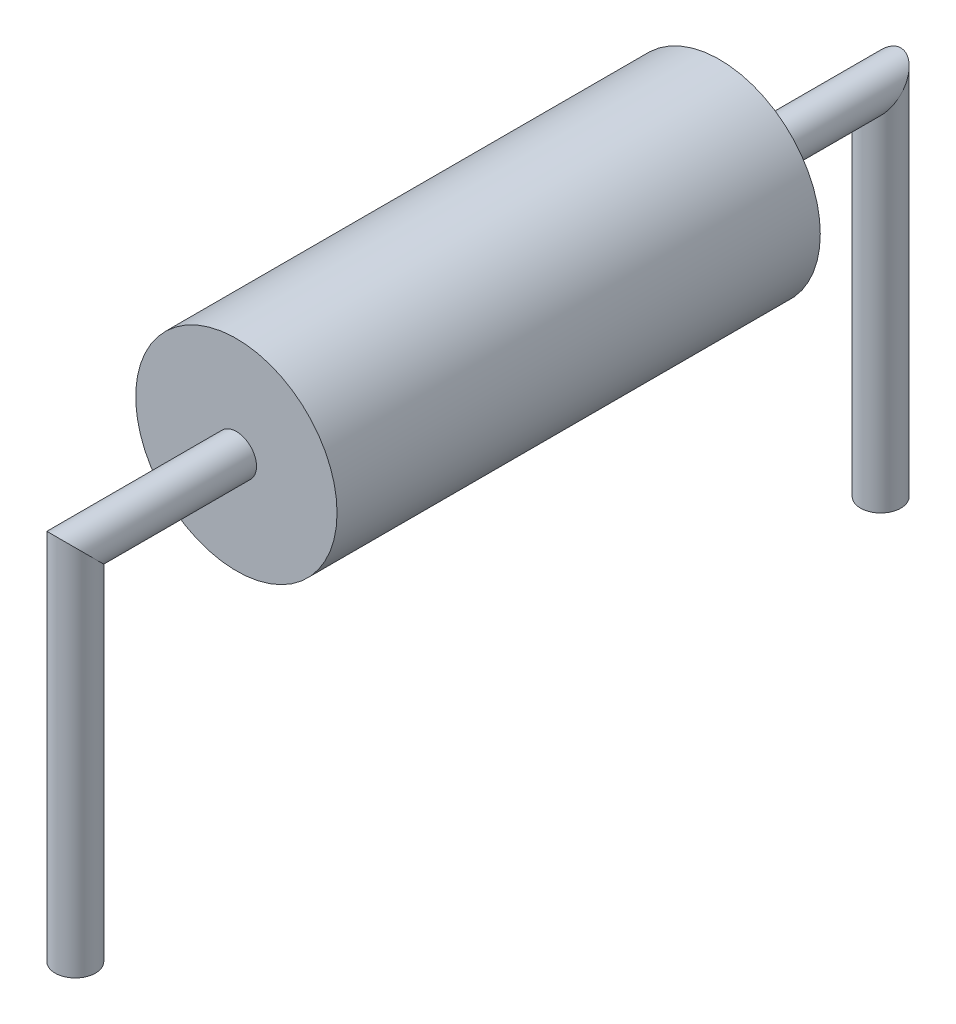
ISO-10303-21;
HEADER;
FILE_DESCRIPTION(('STEP AP214'),'2;1');
FILE_NAME('part.step','',(''),(''),'','','');
FILE_SCHEMA(('AUTOMOTIVE_DESIGN { 1 0 10303 214 1 1 1 1 }'));
ENDSEC;
DATA;
#1=APPLICATION_CONTEXT('core data for automotive mechanical design processes');
#2=APPLICATION_PROTOCOL_DEFINITION('international standard','automotive_design',2000,#1);
#3=PRODUCT_CONTEXT('',#1,'mechanical');
#4=PRODUCT('Part','Part','',(#3));
#5=PRODUCT_RELATED_PRODUCT_CATEGORY('part','',(#4));
#6=PRODUCT_DEFINITION_FORMATION('','',#4);
#7=PRODUCT_DEFINITION_CONTEXT('part definition',#1,'design');
#8=PRODUCT_DEFINITION('design','',#6,#7);
#9=PRODUCT_DEFINITION_SHAPE('','',#8);
#10=(LENGTH_UNIT() NAMED_UNIT(*) SI_UNIT(.MILLI.,.METRE.));
#11=(NAMED_UNIT(*) PLANE_ANGLE_UNIT() SI_UNIT($,.RADIAN.));
#12=(NAMED_UNIT(*) SI_UNIT($,.STERADIAN.) SOLID_ANGLE_UNIT());
#13=UNCERTAINTY_MEASURE_WITH_UNIT(LENGTH_MEASURE(1.E-05),#10,'distance_accuracy_value','');
#14=(GEOMETRIC_REPRESENTATION_CONTEXT(3) GLOBAL_UNCERTAINTY_ASSIGNED_CONTEXT((#13)) GLOBAL_UNIT_ASSIGNED_CONTEXT((#10,
#11,#12)) REPRESENTATION_CONTEXT('',''));
#15=CARTESIAN_POINT('',(0.,0.,0.));
#16=DIRECTION('',(0.,0.,1.));
#17=DIRECTION('',(1.,0.,0.));
#18=AXIS2_PLACEMENT_3D('',#15,#16,#17);
#19=CARTESIAN_POINT('',(0.,1.25,3.));
#20=DIRECTION('',(0.,0.,-1.));
#21=DIRECTION('',(-1.,0.,0.));
#22=AXIS2_PLACEMENT_3D('',#19,#20,#21);
#23=CYLINDRICAL_SURFACE('',#22,1.25);
#24=CARTESIAN_POINT('',(0.,1.25,3.));
#25=DIRECTION('',(0.,0.,1.));
#26=DIRECTION('',(1.,0.,0.));
#27=AXIS2_PLACEMENT_3D('',#24,#25,#26);
#28=CIRCLE('',#27,1.25);
#29=CARTESIAN_POINT('',(1.25,1.25,3.));
#30=VERTEX_POINT('',#29);
#31=EDGE_CURVE('E40',#30,#30,#28,.T.);
#32=ORIENTED_EDGE('',*,*,#31,.F.);
#33=EDGE_LOOP('',(#32));
#34=FACE_BOUND('',#33,.T.);
#35=CARTESIAN_POINT('',(0.,1.25,-3.));
#36=DIRECTION('',(0.,0.,1.));
#37=DIRECTION('',(1.,0.,0.));
#38=AXIS2_PLACEMENT_3D('',#35,#36,#37);
#39=CIRCLE('',#38,1.25);
#40=CARTESIAN_POINT('',(1.25,1.25,-3.));
#41=VERTEX_POINT('',#40);
#42=EDGE_CURVE('E45',#41,#41,#39,.T.);
#43=ORIENTED_EDGE('',*,*,#42,.T.);
#44=EDGE_LOOP('',(#43));
#45=FACE_BOUND('',#44,.T.);
#46=ADVANCED_FACE('F33',(#34,#45),#23,.T.);
#47=CARTESIAN_POINT('',(0.,1.25,3.));
#48=DIRECTION('',(0.,0.,1.));
#49=DIRECTION('',(1.,0.,0.));
#50=AXIS2_PLACEMENT_3D('',#47,#48,#49);
#51=PLANE('',#50);
#52=CARTESIAN_POINT('',(0.,1.25,3.));
#53=DIRECTION('',(0.,0.,1.));
#54=DIRECTION('',(1.,0.,0.));
#55=AXIS2_PLACEMENT_3D('',#52,#53,#54);
#56=CIRCLE('',#55,0.25);
#57=CARTESIAN_POINT('',(0.25,1.25,3.));
#58=VERTEX_POINT('',#57);
#59=EDGE_CURVE('E10',#58,#58,#56,.T.);
#60=ORIENTED_EDGE('',*,*,#59,.F.);
#61=EDGE_LOOP('',(#60));
#62=FACE_BOUND('',#61,.T.);
#63=ORIENTED_EDGE('',*,*,#31,.T.);
#64=EDGE_LOOP('',(#63));
#65=FACE_BOUND('',#64,.T.);
#66=ADVANCED_FACE('F86',(#62,#65),#51,.T.);
#67=CARTESIAN_POINT('',(0.,1.25,-3.));
#68=DIRECTION('',(0.,0.,1.));
#69=DIRECTION('',(1.,0.,0.));
#70=AXIS2_PLACEMENT_3D('',#67,#68,#69);
#71=PLANE('',#70);
#72=CARTESIAN_POINT('',(0.,1.25,-3.));
#73=DIRECTION('',(0.,0.,1.));
#74=DIRECTION('',(1.,0.,0.));
#75=AXIS2_PLACEMENT_3D('',#72,#73,#74);
#76=CIRCLE('',#75,0.25);
#77=CARTESIAN_POINT('',(0.25,1.25,-3.));
#78=VERTEX_POINT('',#77);
#79=EDGE_CURVE('E36',#78,#78,#76,.T.);
#80=ORIENTED_EDGE('',*,*,#79,.T.);
#81=EDGE_LOOP('',(#80));
#82=FACE_BOUND('',#81,.T.);
#83=ORIENTED_EDGE('',*,*,#42,.F.);
#84=EDGE_LOOP('',(#83));
#85=FACE_BOUND('',#84,.T.);
#86=ADVANCED_FACE('F78',(#82,#85),#71,.F.);
#87=CARTESIAN_POINT('',(0.,1.25,-5.25));
#88=DIRECTION('',(0.,0.,1.));
#89=DIRECTION('',(1.,0.,0.));
#90=AXIS2_PLACEMENT_3D('',#87,#88,#89);
#91=CYLINDRICAL_SURFACE('',#90,0.25);
#92=CARTESIAN_POINT('',(0.,1.25,-5.));
#93=DIRECTION('',(0.,-0.707106781186547,-0.707106781186547));
#94=DIRECTION('',(0.,-0.707106781186547,0.707106781186547));
#95=AXIS2_PLACEMENT_3D('',#92,#93,#94);
#96=ELLIPSE('',#95,0.353553390593274,0.25);
#97=CARTESIAN_POINT('',(0.,1.,-4.75));
#98=VERTEX_POINT('',#97);
#99=EDGE_CURVE('E65',#98,#98,#96,.T.);
#100=ORIENTED_EDGE('',*,*,#99,.F.);
#101=EDGE_LOOP('',(#100));
#102=FACE_BOUND('',#101,.T.);
#103=ORIENTED_EDGE('',*,*,#79,.F.);
#104=EDGE_LOOP('',(#103));
#105=FACE_BOUND('',#104,.T.);
#106=ADVANCED_FACE('F74',(#102,#105),#91,.T.);
#107=CARTESIAN_POINT('',(0.,1.25,5.));
#108=DIRECTION('',(0.,-0.707106781186547,0.707106781186547));
#109=DIRECTION('',(0.,-0.707106781186547,-0.707106781186547));
#110=AXIS2_PLACEMENT_3D('',#107,#108,#109);
#111=ELLIPSE('',#110,0.353553390593274,0.25);
#112=CARTESIAN_POINT('',(0.,1.,4.75));
#113=VERTEX_POINT('',#112);
#114=EDGE_CURVE('E57',#113,#113,#111,.T.);
#115=ORIENTED_EDGE('',*,*,#114,.F.);
#116=EDGE_LOOP('',(#115));
#117=FACE_BOUND('',#116,.T.);
#118=ORIENTED_EDGE('',*,*,#59,.T.);
#119=EDGE_LOOP('',(#118));
#120=FACE_BOUND('',#119,.T.);
#121=ADVANCED_FACE('F77',(#117,#120),#91,.T.);
#122=CARTESIAN_POINT('',(0.,-3.2,5.));
#123=DIRECTION('',(0.,1.,0.));
#124=DIRECTION('',(0.,0.,1.));
#125=AXIS2_PLACEMENT_3D('',#122,#123,#124);
#126=CYLINDRICAL_SURFACE('',#125,0.25);
#127=ORIENTED_EDGE('',*,*,#114,.T.);
#128=EDGE_LOOP('',(#127));
#129=FACE_BOUND('',#128,.T.);
#130=CARTESIAN_POINT('',(0.,-3.2,5.));
#131=DIRECTION('',(0.,1.,0.));
#132=DIRECTION('',(0.,0.,1.));
#133=AXIS2_PLACEMENT_3D('',#130,#131,#132);
#134=CIRCLE('',#133,0.25);
#135=CARTESIAN_POINT('',(0.,-3.2,5.25));
#136=VERTEX_POINT('',#135);
#137=EDGE_CURVE('E48',#136,#136,#134,.T.);
#138=ORIENTED_EDGE('',*,*,#137,.T.);
#139=EDGE_LOOP('',(#138));
#140=FACE_BOUND('',#139,.T.);
#141=ADVANCED_FACE('F84',(#129,#140),#126,.T.);
#142=CARTESIAN_POINT('',(0.,-3.2,5.));
#143=DIRECTION('',(0.,1.,0.));
#144=DIRECTION('',(0.,0.,1.));
#145=AXIS2_PLACEMENT_3D('',#142,#143,#144);
#146=PLANE('',#145);
#147=ORIENTED_EDGE('',*,*,#137,.F.);
#148=EDGE_LOOP('',(#147));
#149=FACE_BOUND('',#148,.T.);
#150=ADVANCED_FACE('F123',(#149),#146,.F.);
#151=CARTESIAN_POINT('',(0.,-3.2,-5.));
#152=DIRECTION('',(0.,1.,0.));
#153=DIRECTION('',(0.,0.,1.));
#154=AXIS2_PLACEMENT_3D('',#151,#152,#153);
#155=CYLINDRICAL_SURFACE('',#154,0.25);
#156=ORIENTED_EDGE('',*,*,#99,.T.);
#157=EDGE_LOOP('',(#156));
#158=FACE_BOUND('',#157,.T.);
#159=CARTESIAN_POINT('',(0.,-3.2,-5.));
#160=DIRECTION('',(0.,1.,0.));
#161=DIRECTION('',(0.,0.,1.));
#162=AXIS2_PLACEMENT_3D('',#159,#160,#161);
#163=CIRCLE('',#162,0.25);
#164=CARTESIAN_POINT('',(0.,-3.2,-4.75));
#165=VERTEX_POINT('',#164);
#166=EDGE_CURVE('E61',#165,#165,#163,.T.);
#167=ORIENTED_EDGE('',*,*,#166,.T.);
#168=EDGE_LOOP('',(#167));
#169=FACE_BOUND('',#168,.T.);
#170=ADVANCED_FACE('F71',(#158,#169),#155,.T.);
#171=CARTESIAN_POINT('',(0.,-3.2,-5.));
#172=DIRECTION('',(0.,1.,0.));
#173=DIRECTION('',(0.,0.,1.));
#174=AXIS2_PLACEMENT_3D('',#171,#172,#173);
#175=PLANE('',#174);
#176=ORIENTED_EDGE('',*,*,#166,.F.);
#177=EDGE_LOOP('',(#176));
#178=FACE_BOUND('',#177,.T.);
#179=ADVANCED_FACE('F142',(#178),#175,.F.);
#180=CLOSED_SHELL('',(#46,#66,#86,#106,#121,#141,#150,#170,#179));
#181=MANIFOLD_SOLID_BREP('B2',#180);
#182=ADVANCED_BREP_SHAPE_REPRESENTATION('',(#18,#181),#14);
#183=SHAPE_DEFINITION_REPRESENTATION(#9,#182);
ENDSEC;
END-ISO-10303-21;
